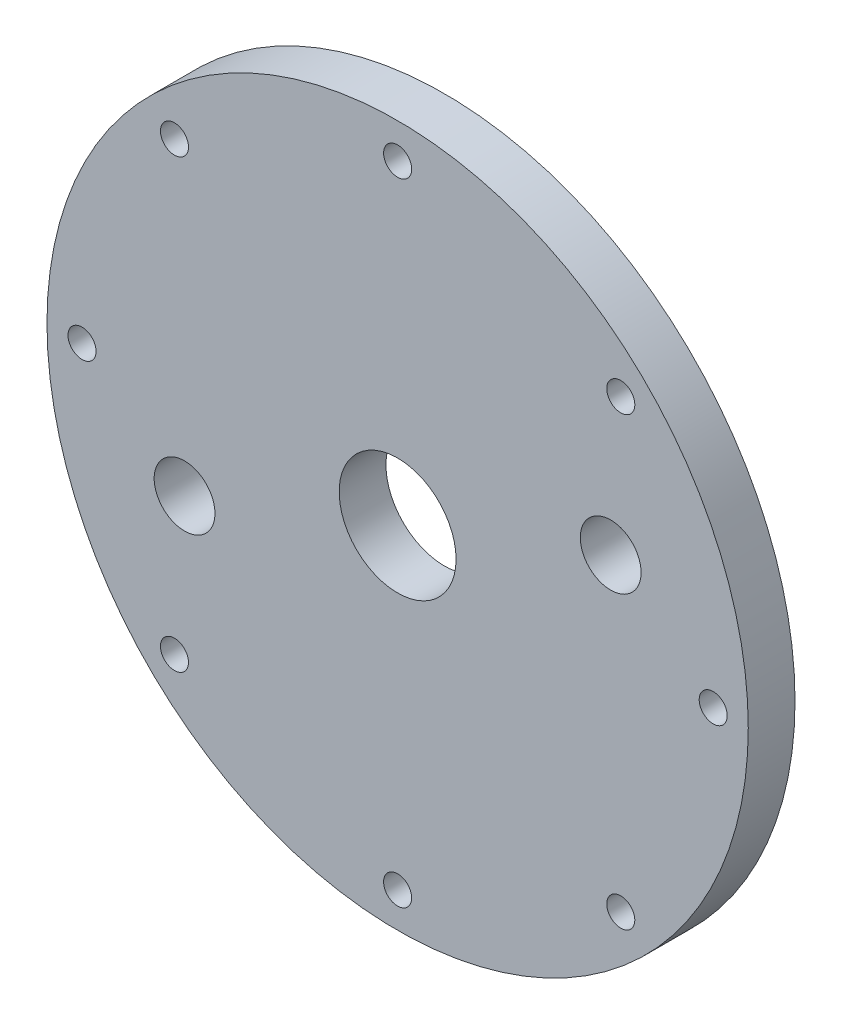
ISO-10303-21;
HEADER;
FILE_DESCRIPTION(('STEP AP214'),'2;1');
FILE_NAME('part.step','',(''),(''),'','','');
FILE_SCHEMA(('AUTOMOTIVE_DESIGN { 1 0 10303 214 1 1 1 1 }'));
ENDSEC;
DATA;
#1=APPLICATION_CONTEXT('core data for automotive mechanical design processes');
#2=APPLICATION_PROTOCOL_DEFINITION('international standard','automotive_design',2000,#1);
#3=PRODUCT_CONTEXT('',#1,'mechanical');
#4=PRODUCT('Part','Part','',(#3));
#5=PRODUCT_RELATED_PRODUCT_CATEGORY('part','',(#4));
#6=PRODUCT_DEFINITION_FORMATION('','',#4);
#7=PRODUCT_DEFINITION_CONTEXT('part definition',#1,'design');
#8=PRODUCT_DEFINITION('design','',#6,#7);
#9=PRODUCT_DEFINITION_SHAPE('','',#8);
#10=(LENGTH_UNIT() NAMED_UNIT(*) SI_UNIT(.MILLI.,.METRE.));
#11=(NAMED_UNIT(*) PLANE_ANGLE_UNIT() SI_UNIT($,.RADIAN.));
#12=(NAMED_UNIT(*) SI_UNIT($,.STERADIAN.) SOLID_ANGLE_UNIT());
#13=UNCERTAINTY_MEASURE_WITH_UNIT(LENGTH_MEASURE(1.E-05),#10,'distance_accuracy_value','');
#14=(GEOMETRIC_REPRESENTATION_CONTEXT(3) GLOBAL_UNCERTAINTY_ASSIGNED_CONTEXT((#13)) GLOBAL_UNIT_ASSIGNED_CONTEXT((#10,
#11,#12)) REPRESENTATION_CONTEXT('',''));
#15=CARTESIAN_POINT('',(0.,0.,0.));
#16=DIRECTION('',(0.,0.,1.));
#17=DIRECTION('',(1.,0.,0.));
#18=AXIS2_PLACEMENT_3D('',#15,#16,#17);
#19=CARTESIAN_POINT('',(0.,0.,10.));
#20=DIRECTION('',(0.,0.,1.));
#21=DIRECTION('',(1.,0.,0.));
#22=AXIS2_PLACEMENT_3D('',#19,#20,#21);
#23=PLANE('',#22);
#24=CARTESIAN_POINT('',(-45.5708669472794,-17.3164253145202,10.));
#25=DIRECTION('',(0.,0.,1.));
#26=DIRECTION('',(1.,0.,0.));
#27=AXIS2_PLACEMENT_3D('',#24,#25,#26);
#28=CIRCLE('',#27,6.5);
#29=CARTESIAN_POINT('',(-39.0708669472794,-17.3164253145202,10.));
#30=VERTEX_POINT('',#29);
#31=EDGE_CURVE('E113',#30,#30,#28,.T.);
#32=ORIENTED_EDGE('',*,*,#31,.F.);
#33=EDGE_LOOP('',(#32));
#34=FACE_BOUND('',#33,.T.);
#35=CARTESIAN_POINT('',(45.5708669472794,17.3164253145202,10.));
#36=DIRECTION('',(0.,0.,1.));
#37=DIRECTION('',(1.,0.,0.));
#38=AXIS2_PLACEMENT_3D('',#35,#36,#37);
#39=CIRCLE('',#38,6.5);
#40=CARTESIAN_POINT('',(52.0708669472794,17.3164253145202,10.));
#41=VERTEX_POINT('',#40);
#42=EDGE_CURVE('E110',#41,#41,#39,.T.);
#43=ORIENTED_EDGE('',*,*,#42,.F.);
#44=EDGE_LOOP('',(#43));
#45=FACE_BOUND('',#44,.T.);
#46=CARTESIAN_POINT('',(-67.5,7.07024971115735E-13,10.));
#47=DIRECTION('',(0.,0.,1.));
#48=DIRECTION('',(1.,0.,0.));
#49=AXIS2_PLACEMENT_3D('',#46,#47,#48);
#50=CIRCLE('',#49,3.);
#51=CARTESIAN_POINT('',(-64.5,7.07024971115735E-13,10.));
#52=VERTEX_POINT('',#51);
#53=EDGE_CURVE('E92',#52,#52,#50,.T.);
#54=ORIENTED_EDGE('',*,*,#53,.F.);
#55=EDGE_LOOP('',(#54));
#56=FACE_BOUND('',#55,.T.);
#57=CARTESIAN_POINT('',(-4.71349980743823E-13,-67.5,10.));
#58=DIRECTION('',(0.,0.,1.));
#59=DIRECTION('',(1.,0.,0.));
#60=AXIS2_PLACEMENT_3D('',#57,#58,#59);
#61=CIRCLE('',#60,3.);
#62=CARTESIAN_POINT('',(2.99999999999953,-67.5,10.));
#63=VERTEX_POINT('',#62);
#64=EDGE_CURVE('E80',#63,#63,#61,.T.);
#65=ORIENTED_EDGE('',*,*,#64,.F.);
#66=EDGE_LOOP('',(#65));
#67=FACE_BOUND('',#66,.T.);
#68=CARTESIAN_POINT('',(67.5,-2.35674990371912E-13,10.));
#69=DIRECTION('',(0.,0.,1.));
#70=DIRECTION('',(1.,0.,0.));
#71=AXIS2_PLACEMENT_3D('',#68,#69,#70);
#72=CIRCLE('',#71,3.);
#73=CARTESIAN_POINT('',(70.5,-2.35674990371912E-13,10.));
#74=VERTEX_POINT('',#73);
#75=EDGE_CURVE('E68',#74,#74,#72,.T.);
#76=ORIENTED_EDGE('',*,*,#75,.F.);
#77=EDGE_LOOP('',(#76));
#78=FACE_BOUND('',#77,.T.);
#79=CARTESIAN_POINT('',(0.,0.,10.));
#80=DIRECTION('',(0.,0.,1.));
#81=DIRECTION('',(1.,0.,0.));
#82=AXIS2_PLACEMENT_3D('',#79,#80,#81);
#83=CIRCLE('',#82,12.5);
#84=CARTESIAN_POINT('',(12.5,0.,10.));
#85=VERTEX_POINT('',#84);
#86=EDGE_CURVE('E56',#85,#85,#83,.T.);
#87=ORIENTED_EDGE('',*,*,#86,.F.);
#88=EDGE_LOOP('',(#87));
#89=FACE_BOUND('',#88,.T.);
#90=CARTESIAN_POINT('',(0.,0.,10.));
#91=DIRECTION('',(0.,0.,1.));
#92=DIRECTION('',(1.,0.,0.));
#93=AXIS2_PLACEMENT_3D('',#90,#91,#92);
#94=CIRCLE('',#93,75.);
#95=CARTESIAN_POINT('',(75.,0.,10.));
#96=VERTEX_POINT('',#95);
#97=EDGE_CURVE('E10',#96,#96,#94,.T.);
#98=ORIENTED_EDGE('',*,*,#97,.T.);
#99=EDGE_LOOP('',(#98));
#100=FACE_BOUND('',#99,.T.);
#101=CARTESIAN_POINT('',(0.,67.5,10.));
#102=DIRECTION('',(0.,0.,1.));
#103=DIRECTION('',(1.,0.,0.));
#104=AXIS2_PLACEMENT_3D('',#101,#102,#103);
#105=CIRCLE('',#104,3.);
#106=CARTESIAN_POINT('',(3.,67.5,10.));
#107=VERTEX_POINT('',#106);
#108=EDGE_CURVE('E51',#107,#107,#105,.T.);
#109=ORIENTED_EDGE('',*,*,#108,.F.);
#110=EDGE_LOOP('',(#109));
#111=FACE_BOUND('',#110,.T.);
#112=CARTESIAN_POINT('',(47.7297077300921,47.7297077300919,10.));
#113=DIRECTION('',(0.,0.,1.));
#114=DIRECTION('',(1.,0.,0.));
#115=AXIS2_PLACEMENT_3D('',#112,#113,#114);
#116=CIRCLE('',#115,3.);
#117=CARTESIAN_POINT('',(50.7297077300921,47.7297077300919,10.));
#118=VERTEX_POINT('',#117);
#119=EDGE_CURVE('E62',#118,#118,#116,.T.);
#120=ORIENTED_EDGE('',*,*,#119,.F.);
#121=EDGE_LOOP('',(#120));
#122=FACE_BOUND('',#121,.T.);
#123=CARTESIAN_POINT('',(47.7297077300917,-47.7297077300922,10.));
#124=DIRECTION('',(0.,0.,1.));
#125=DIRECTION('',(1.,0.,0.));
#126=AXIS2_PLACEMENT_3D('',#123,#124,#125);
#127=CIRCLE('',#126,3.);
#128=CARTESIAN_POINT('',(50.7297077300917,-47.7297077300922,10.));
#129=VERTEX_POINT('',#128);
#130=EDGE_CURVE('E74',#129,#129,#127,.T.);
#131=ORIENTED_EDGE('',*,*,#130,.F.);
#132=EDGE_LOOP('',(#131));
#133=FACE_BOUND('',#132,.T.);
#134=CARTESIAN_POINT('',(-47.7297077300924,-47.7297077300915,10.));
#135=DIRECTION('',(0.,0.,1.));
#136=DIRECTION('',(1.,0.,0.));
#137=AXIS2_PLACEMENT_3D('',#134,#135,#136);
#138=CIRCLE('',#137,3.);
#139=CARTESIAN_POINT('',(-44.7297077300924,-47.7297077300915,10.));
#140=VERTEX_POINT('',#139);
#141=EDGE_CURVE('E86',#140,#140,#138,.T.);
#142=ORIENTED_EDGE('',*,*,#141,.F.);
#143=EDGE_LOOP('',(#142));
#144=FACE_BOUND('',#143,.T.);
#145=CARTESIAN_POINT('',(-47.7297077300914,47.7297077300925,10.));
#146=DIRECTION('',(0.,0.,1.));
#147=DIRECTION('',(1.,0.,0.));
#148=AXIS2_PLACEMENT_3D('',#145,#146,#147);
#149=CIRCLE('',#148,3.);
#150=CARTESIAN_POINT('',(-44.7297077300914,47.7297077300925,10.));
#151=VERTEX_POINT('',#150);
#152=EDGE_CURVE('E98',#151,#151,#149,.T.);
#153=ORIENTED_EDGE('',*,*,#152,.F.);
#154=EDGE_LOOP('',(#153));
#155=FACE_BOUND('',#154,.T.);
#156=ADVANCED_FACE('F40',(#34,#45,#56,#67,#78,#89,#100,#111,#122,#133,#144,#155),#23,.T.);
#157=CARTESIAN_POINT('',(0.,0.,0.));
#158=DIRECTION('',(0.,0.,1.));
#159=DIRECTION('',(1.,0.,0.));
#160=AXIS2_PLACEMENT_3D('',#157,#158,#159);
#161=PLANE('',#160);
#162=CARTESIAN_POINT('',(-45.5708669472794,-17.3164253145202,0.));
#163=DIRECTION('',(0.,0.,1.));
#164=DIRECTION('',(1.,0.,0.));
#165=AXIS2_PLACEMENT_3D('',#162,#163,#164);
#166=CIRCLE('',#165,6.5);
#167=CARTESIAN_POINT('',(-39.0708669472794,-17.3164253145202,0.));
#168=VERTEX_POINT('',#167);
#169=EDGE_CURVE('E104',#168,#168,#166,.T.);
#170=ORIENTED_EDGE('',*,*,#169,.T.);
#171=EDGE_LOOP('',(#170));
#172=FACE_BOUND('',#171,.T.);
#173=CARTESIAN_POINT('',(45.5708669472794,17.3164253145202,0.));
#174=DIRECTION('',(0.,0.,1.));
#175=DIRECTION('',(1.,0.,0.));
#176=AXIS2_PLACEMENT_3D('',#173,#174,#175);
#177=CIRCLE('',#176,6.5);
#178=CARTESIAN_POINT('',(52.0708669472794,17.3164253145202,0.));
#179=VERTEX_POINT('',#178);
#180=EDGE_CURVE('E107',#179,#179,#177,.T.);
#181=ORIENTED_EDGE('',*,*,#180,.T.);
#182=EDGE_LOOP('',(#181));
#183=FACE_BOUND('',#182,.T.);
#184=CARTESIAN_POINT('',(0.,0.,0.));
#185=DIRECTION('',(0.,0.,1.));
#186=DIRECTION('',(1.,0.,0.));
#187=AXIS2_PLACEMENT_3D('',#184,#185,#186);
#188=CIRCLE('',#187,75.);
#189=CARTESIAN_POINT('',(75.,0.,0.));
#190=VERTEX_POINT('',#189);
#191=EDGE_CURVE('E44',#190,#190,#188,.T.);
#192=ORIENTED_EDGE('',*,*,#191,.F.);
#193=EDGE_LOOP('',(#192));
#194=FACE_BOUND('',#193,.T.);
#195=CARTESIAN_POINT('',(0.,67.5,0.));
#196=DIRECTION('',(0.,0.,1.));
#197=DIRECTION('',(1.,0.,0.));
#198=AXIS2_PLACEMENT_3D('',#195,#196,#197);
#199=CIRCLE('',#198,3.);
#200=CARTESIAN_POINT('',(3.,67.5,0.));
#201=VERTEX_POINT('',#200);
#202=EDGE_CURVE('E53',#201,#201,#199,.T.);
#203=ORIENTED_EDGE('',*,*,#202,.T.);
#204=EDGE_LOOP('',(#203));
#205=FACE_BOUND('',#204,.T.);
#206=CARTESIAN_POINT('',(0.,0.,0.));
#207=DIRECTION('',(0.,0.,1.));
#208=DIRECTION('',(1.,0.,0.));
#209=AXIS2_PLACEMENT_3D('',#206,#207,#208);
#210=CIRCLE('',#209,12.5);
#211=CARTESIAN_POINT('',(12.5,0.,0.));
#212=VERTEX_POINT('',#211);
#213=EDGE_CURVE('E59',#212,#212,#210,.T.);
#214=ORIENTED_EDGE('',*,*,#213,.T.);
#215=EDGE_LOOP('',(#214));
#216=FACE_BOUND('',#215,.T.);
#217=CARTESIAN_POINT('',(47.7297077300921,47.7297077300919,0.));
#218=DIRECTION('',(0.,0.,1.));
#219=DIRECTION('',(1.,0.,0.));
#220=AXIS2_PLACEMENT_3D('',#217,#218,#219);
#221=CIRCLE('',#220,3.);
#222=CARTESIAN_POINT('',(50.7297077300921,47.7297077300919,0.));
#223=VERTEX_POINT('',#222);
#224=EDGE_CURVE('E65',#223,#223,#221,.T.);
#225=ORIENTED_EDGE('',*,*,#224,.T.);
#226=EDGE_LOOP('',(#225));
#227=FACE_BOUND('',#226,.T.);
#228=CARTESIAN_POINT('',(67.5,-2.35674990371912E-13,0.));
#229=DIRECTION('',(0.,0.,1.));
#230=DIRECTION('',(1.,0.,0.));
#231=AXIS2_PLACEMENT_3D('',#228,#229,#230);
#232=CIRCLE('',#231,3.);
#233=CARTESIAN_POINT('',(70.5,-2.35674990371912E-13,0.));
#234=VERTEX_POINT('',#233);
#235=EDGE_CURVE('E71',#234,#234,#232,.T.);
#236=ORIENTED_EDGE('',*,*,#235,.T.);
#237=EDGE_LOOP('',(#236));
#238=FACE_BOUND('',#237,.T.);
#239=CARTESIAN_POINT('',(47.7297077300917,-47.7297077300922,0.));
#240=DIRECTION('',(0.,0.,1.));
#241=DIRECTION('',(1.,0.,0.));
#242=AXIS2_PLACEMENT_3D('',#239,#240,#241);
#243=CIRCLE('',#242,3.);
#244=CARTESIAN_POINT('',(50.7297077300917,-47.7297077300922,0.));
#245=VERTEX_POINT('',#244);
#246=EDGE_CURVE('E77',#245,#245,#243,.T.);
#247=ORIENTED_EDGE('',*,*,#246,.T.);
#248=EDGE_LOOP('',(#247));
#249=FACE_BOUND('',#248,.T.);
#250=CARTESIAN_POINT('',(-4.71349980743823E-13,-67.5,0.));
#251=DIRECTION('',(0.,0.,1.));
#252=DIRECTION('',(1.,0.,0.));
#253=AXIS2_PLACEMENT_3D('',#250,#251,#252);
#254=CIRCLE('',#253,3.);
#255=CARTESIAN_POINT('',(2.99999999999953,-67.5,0.));
#256=VERTEX_POINT('',#255);
#257=EDGE_CURVE('E83',#256,#256,#254,.T.);
#258=ORIENTED_EDGE('',*,*,#257,.T.);
#259=EDGE_LOOP('',(#258));
#260=FACE_BOUND('',#259,.T.);
#261=CARTESIAN_POINT('',(-47.7297077300924,-47.7297077300915,0.));
#262=DIRECTION('',(0.,0.,1.));
#263=DIRECTION('',(1.,0.,0.));
#264=AXIS2_PLACEMENT_3D('',#261,#262,#263);
#265=CIRCLE('',#264,3.);
#266=CARTESIAN_POINT('',(-44.7297077300924,-47.7297077300915,0.));
#267=VERTEX_POINT('',#266);
#268=EDGE_CURVE('E89',#267,#267,#265,.T.);
#269=ORIENTED_EDGE('',*,*,#268,.T.);
#270=EDGE_LOOP('',(#269));
#271=FACE_BOUND('',#270,.T.);
#272=CARTESIAN_POINT('',(-67.5,7.07024971115735E-13,0.));
#273=DIRECTION('',(0.,0.,1.));
#274=DIRECTION('',(1.,0.,0.));
#275=AXIS2_PLACEMENT_3D('',#272,#273,#274);
#276=CIRCLE('',#275,3.);
#277=CARTESIAN_POINT('',(-64.5,7.07024971115735E-13,0.));
#278=VERTEX_POINT('',#277);
#279=EDGE_CURVE('E95',#278,#278,#276,.T.);
#280=ORIENTED_EDGE('',*,*,#279,.T.);
#281=EDGE_LOOP('',(#280));
#282=FACE_BOUND('',#281,.T.);
#283=CARTESIAN_POINT('',(-47.7297077300914,47.7297077300925,0.));
#284=DIRECTION('',(0.,0.,1.));
#285=DIRECTION('',(1.,0.,0.));
#286=AXIS2_PLACEMENT_3D('',#283,#284,#285);
#287=CIRCLE('',#286,3.);
#288=CARTESIAN_POINT('',(-44.7297077300914,47.7297077300925,0.));
#289=VERTEX_POINT('',#288);
#290=EDGE_CURVE('E101',#289,#289,#287,.T.);
#291=ORIENTED_EDGE('',*,*,#290,.T.);
#292=EDGE_LOOP('',(#291));
#293=FACE_BOUND('',#292,.T.);
#294=ADVANCED_FACE('F119',(#172,#183,#194,#205,#216,#227,#238,#249,#260,#271,#282,#293),#161,.F.);
#295=CARTESIAN_POINT('',(0.,0.,10.));
#296=DIRECTION('',(0.,0.,-1.));
#297=DIRECTION('',(-1.,0.,0.));
#298=AXIS2_PLACEMENT_3D('',#295,#296,#297);
#299=CYLINDRICAL_SURFACE('',#298,75.);
#300=ORIENTED_EDGE('',*,*,#97,.F.);
#301=EDGE_LOOP('',(#300));
#302=FACE_BOUND('',#301,.T.);
#303=ORIENTED_EDGE('',*,*,#191,.T.);
#304=EDGE_LOOP('',(#303));
#305=FACE_BOUND('',#304,.T.);
#306=ADVANCED_FACE('F42',(#302,#305),#299,.T.);
#307=CARTESIAN_POINT('',(0.,67.5,10.));
#308=DIRECTION('',(0.,0.,-1.));
#309=DIRECTION('',(-1.,0.,0.));
#310=AXIS2_PLACEMENT_3D('',#307,#308,#309);
#311=CYLINDRICAL_SURFACE('',#310,3.);
#312=ORIENTED_EDGE('',*,*,#108,.T.);
#313=EDGE_LOOP('',(#312));
#314=FACE_BOUND('',#313,.T.);
#315=ORIENTED_EDGE('',*,*,#202,.F.);
#316=EDGE_LOOP('',(#315));
#317=FACE_BOUND('',#316,.T.);
#318=ADVANCED_FACE('F164',(#314,#317),#311,.F.);
#319=CARTESIAN_POINT('',(0.,0.,10.));
#320=DIRECTION('',(0.,0.,-1.));
#321=DIRECTION('',(-1.,0.,0.));
#322=AXIS2_PLACEMENT_3D('',#319,#320,#321);
#323=CYLINDRICAL_SURFACE('',#322,12.5);
#324=ORIENTED_EDGE('',*,*,#86,.T.);
#325=EDGE_LOOP('',(#324));
#326=FACE_BOUND('',#325,.T.);
#327=ORIENTED_EDGE('',*,*,#213,.F.);
#328=EDGE_LOOP('',(#327));
#329=FACE_BOUND('',#328,.T.);
#330=ADVANCED_FACE('F169',(#326,#329),#323,.F.);
#331=CARTESIAN_POINT('',(47.7297077300921,47.7297077300919,10.));
#332=DIRECTION('',(0.,0.,-1.));
#333=DIRECTION('',(-1.,0.,0.));
#334=AXIS2_PLACEMENT_3D('',#331,#332,#333);
#335=CYLINDRICAL_SURFACE('',#334,3.);
#336=ORIENTED_EDGE('',*,*,#119,.T.);
#337=EDGE_LOOP('',(#336));
#338=FACE_BOUND('',#337,.T.);
#339=ORIENTED_EDGE('',*,*,#224,.F.);
#340=EDGE_LOOP('',(#339));
#341=FACE_BOUND('',#340,.T.);
#342=ADVANCED_FACE('F173',(#338,#341),#335,.F.);
#343=CARTESIAN_POINT('',(67.5,-2.35674990371912E-13,10.));
#344=DIRECTION('',(0.,0.,-1.));
#345=DIRECTION('',(-1.,0.,0.));
#346=AXIS2_PLACEMENT_3D('',#343,#344,#345);
#347=CYLINDRICAL_SURFACE('',#346,3.);
#348=ORIENTED_EDGE('',*,*,#75,.T.);
#349=EDGE_LOOP('',(#348));
#350=FACE_BOUND('',#349,.T.);
#351=ORIENTED_EDGE('',*,*,#235,.F.);
#352=EDGE_LOOP('',(#351));
#353=FACE_BOUND('',#352,.T.);
#354=ADVANCED_FACE('F177',(#350,#353),#347,.F.);
#355=CARTESIAN_POINT('',(47.7297077300917,-47.7297077300922,10.));
#356=DIRECTION('',(0.,0.,-1.));
#357=DIRECTION('',(-1.,0.,0.));
#358=AXIS2_PLACEMENT_3D('',#355,#356,#357);
#359=CYLINDRICAL_SURFACE('',#358,3.);
#360=ORIENTED_EDGE('',*,*,#130,.T.);
#361=EDGE_LOOP('',(#360));
#362=FACE_BOUND('',#361,.T.);
#363=ORIENTED_EDGE('',*,*,#246,.F.);
#364=EDGE_LOOP('',(#363));
#365=FACE_BOUND('',#364,.T.);
#366=ADVANCED_FACE('F181',(#362,#365),#359,.F.);
#367=CARTESIAN_POINT('',(-4.71349980743823E-13,-67.5,10.));
#368=DIRECTION('',(0.,0.,-1.));
#369=DIRECTION('',(-1.,0.,0.));
#370=AXIS2_PLACEMENT_3D('',#367,#368,#369);
#371=CYLINDRICAL_SURFACE('',#370,3.);
#372=ORIENTED_EDGE('',*,*,#64,.T.);
#373=EDGE_LOOP('',(#372));
#374=FACE_BOUND('',#373,.T.);
#375=ORIENTED_EDGE('',*,*,#257,.F.);
#376=EDGE_LOOP('',(#375));
#377=FACE_BOUND('',#376,.T.);
#378=ADVANCED_FACE('F185',(#374,#377),#371,.F.);
#379=CARTESIAN_POINT('',(-47.7297077300924,-47.7297077300915,10.));
#380=DIRECTION('',(0.,0.,-1.));
#381=DIRECTION('',(-1.,0.,0.));
#382=AXIS2_PLACEMENT_3D('',#379,#380,#381);
#383=CYLINDRICAL_SURFACE('',#382,3.);
#384=ORIENTED_EDGE('',*,*,#141,.T.);
#385=EDGE_LOOP('',(#384));
#386=FACE_BOUND('',#385,.T.);
#387=ORIENTED_EDGE('',*,*,#268,.F.);
#388=EDGE_LOOP('',(#387));
#389=FACE_BOUND('',#388,.T.);
#390=ADVANCED_FACE('F189',(#386,#389),#383,.F.);
#391=CARTESIAN_POINT('',(-67.5,7.07024971115735E-13,10.));
#392=DIRECTION('',(0.,0.,-1.));
#393=DIRECTION('',(-1.,0.,0.));
#394=AXIS2_PLACEMENT_3D('',#391,#392,#393);
#395=CYLINDRICAL_SURFACE('',#394,3.);
#396=ORIENTED_EDGE('',*,*,#53,.T.);
#397=EDGE_LOOP('',(#396));
#398=FACE_BOUND('',#397,.T.);
#399=ORIENTED_EDGE('',*,*,#279,.F.);
#400=EDGE_LOOP('',(#399));
#401=FACE_BOUND('',#400,.T.);
#402=ADVANCED_FACE('F155',(#398,#401),#395,.F.);
#403=CARTESIAN_POINT('',(-47.7297077300914,47.7297077300925,10.));
#404=DIRECTION('',(0.,0.,-1.));
#405=DIRECTION('',(-1.,0.,0.));
#406=AXIS2_PLACEMENT_3D('',#403,#404,#405);
#407=CYLINDRICAL_SURFACE('',#406,3.);
#408=ORIENTED_EDGE('',*,*,#152,.T.);
#409=EDGE_LOOP('',(#408));
#410=FACE_BOUND('',#409,.T.);
#411=ORIENTED_EDGE('',*,*,#290,.F.);
#412=EDGE_LOOP('',(#411));
#413=FACE_BOUND('',#412,.T.);
#414=ADVANCED_FACE('F152',(#410,#413),#407,.F.);
#415=CARTESIAN_POINT('',(45.5708669472794,17.3164253145202,0.));
#416=DIRECTION('',(0.,0.,1.));
#417=DIRECTION('',(1.,0.,0.));
#418=AXIS2_PLACEMENT_3D('',#415,#416,#417);
#419=CYLINDRICAL_SURFACE('',#418,6.5);
#420=ORIENTED_EDGE('',*,*,#180,.F.);
#421=EDGE_LOOP('',(#420));
#422=FACE_BOUND('',#421,.T.);
#423=ORIENTED_EDGE('',*,*,#42,.T.);
#424=EDGE_LOOP('',(#423));
#425=FACE_BOUND('',#424,.T.);
#426=ADVANCED_FACE('F125',(#422,#425),#419,.F.);
#427=CARTESIAN_POINT('',(-45.5708669472794,-17.3164253145202,0.));
#428=DIRECTION('',(0.,0.,1.));
#429=DIRECTION('',(1.,0.,0.));
#430=AXIS2_PLACEMENT_3D('',#427,#428,#429);
#431=CYLINDRICAL_SURFACE('',#430,6.5);
#432=ORIENTED_EDGE('',*,*,#169,.F.);
#433=EDGE_LOOP('',(#432));
#434=FACE_BOUND('',#433,.T.);
#435=ORIENTED_EDGE('',*,*,#31,.T.);
#436=EDGE_LOOP('',(#435));
#437=FACE_BOUND('',#436,.T.);
#438=ADVANCED_FACE('F122',(#434,#437),#431,.F.);
#439=CLOSED_SHELL('',(#156,#294,#306,#318,#330,#342,#354,#366,#378,#390,#402,#414,#426,#438));
#440=MANIFOLD_SOLID_BREP('B2',#439);
#441=ADVANCED_BREP_SHAPE_REPRESENTATION('',(#18,#440),#14);
#442=SHAPE_DEFINITION_REPRESENTATION(#9,#441);
ENDSEC;
END-ISO-10303-21;
